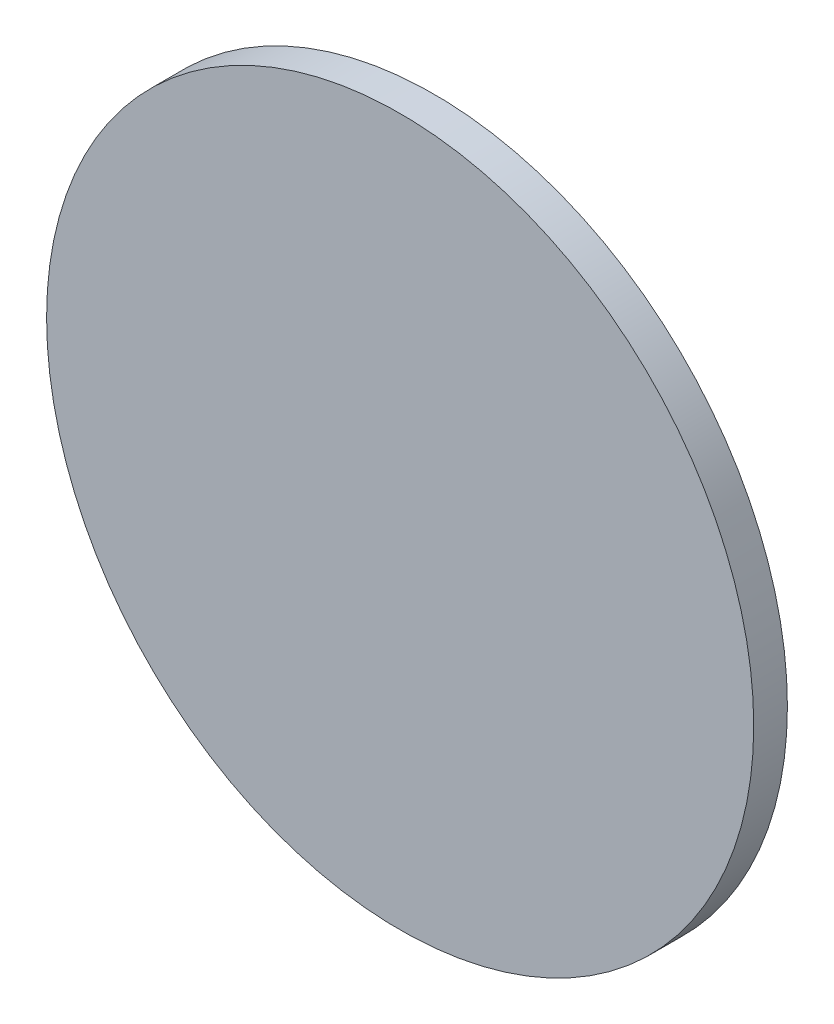
ISO-10303-21;
HEADER;
FILE_DESCRIPTION(('STEP AP214'),'2;1');
FILE_NAME('part.step','',(''),(''),'','','');
FILE_SCHEMA(('AUTOMOTIVE_DESIGN { 1 0 10303 214 1 1 1 1 }'));
ENDSEC;
DATA;
#1=APPLICATION_CONTEXT('core data for automotive mechanical design processes');
#2=APPLICATION_PROTOCOL_DEFINITION('international standard','automotive_design',2000,#1);
#3=PRODUCT_CONTEXT('',#1,'mechanical');
#4=PRODUCT('Part','Part','',(#3));
#5=PRODUCT_RELATED_PRODUCT_CATEGORY('part','',(#4));
#6=PRODUCT_DEFINITION_FORMATION('','',#4);
#7=PRODUCT_DEFINITION_CONTEXT('part definition',#1,'design');
#8=PRODUCT_DEFINITION('design','',#6,#7);
#9=PRODUCT_DEFINITION_SHAPE('','',#8);
#10=(LENGTH_UNIT() NAMED_UNIT(*) SI_UNIT(.MILLI.,.METRE.));
#11=(NAMED_UNIT(*) PLANE_ANGLE_UNIT() SI_UNIT($,.RADIAN.));
#12=(NAMED_UNIT(*) SI_UNIT($,.STERADIAN.) SOLID_ANGLE_UNIT());
#13=UNCERTAINTY_MEASURE_WITH_UNIT(LENGTH_MEASURE(1.E-05),#10,'distance_accuracy_value','');
#14=(GEOMETRIC_REPRESENTATION_CONTEXT(3) GLOBAL_UNCERTAINTY_ASSIGNED_CONTEXT((#13)) GLOBAL_UNIT_ASSIGNED_CONTEXT((#10,
#11,#12)) REPRESENTATION_CONTEXT('',''));
#15=CARTESIAN_POINT('',(0.,0.,0.));
#16=DIRECTION('',(0.,0.,1.));
#17=DIRECTION('',(1.,0.,0.));
#18=AXIS2_PLACEMENT_3D('',#15,#16,#17);
#19=CARTESIAN_POINT('',(0.,0.,5.08));
#20=DIRECTION('',(0.,0.,-1.));
#21=DIRECTION('',(-1.,0.,0.));
#22=AXIS2_PLACEMENT_3D('',#19,#20,#21);
#23=CYLINDRICAL_SURFACE('',#22,53.34);
#24=CARTESIAN_POINT('',(0.,0.,5.08));
#25=DIRECTION('',(0.,0.,1.));
#26=DIRECTION('',(1.,0.,0.));
#27=AXIS2_PLACEMENT_3D('',#24,#25,#26);
#28=CIRCLE('',#27,53.34);
#29=CARTESIAN_POINT('',(53.34,0.,5.08));
#30=VERTEX_POINT('',#29);
#31=EDGE_CURVE('E10',#30,#30,#28,.T.);
#32=ORIENTED_EDGE('',*,*,#31,.F.);
#33=EDGE_LOOP('',(#32));
#34=FACE_BOUND('',#33,.T.);
#35=CARTESIAN_POINT('',(0.,0.,0.));
#36=DIRECTION('',(0.,0.,1.));
#37=DIRECTION('',(1.,0.,0.));
#38=AXIS2_PLACEMENT_3D('',#35,#36,#37);
#39=CIRCLE('',#38,53.34);
#40=CARTESIAN_POINT('',(53.34,0.,0.));
#41=VERTEX_POINT('',#40);
#42=EDGE_CURVE('E36',#41,#41,#39,.T.);
#43=ORIENTED_EDGE('',*,*,#42,.T.);
#44=EDGE_LOOP('',(#43));
#45=FACE_BOUND('',#44,.T.);
#46=ADVANCED_FACE('F33',(#34,#45),#23,.T.);
#47=CARTESIAN_POINT('',(0.,0.,5.08));
#48=DIRECTION('',(0.,0.,1.));
#49=DIRECTION('',(1.,0.,0.));
#50=AXIS2_PLACEMENT_3D('',#47,#48,#49);
#51=PLANE('',#50);
#52=ORIENTED_EDGE('',*,*,#31,.T.);
#53=EDGE_LOOP('',(#52));
#54=FACE_BOUND('',#53,.T.);
#55=ADVANCED_FACE('F48',(#54),#51,.T.);
#56=CARTESIAN_POINT('',(0.,0.,0.));
#57=DIRECTION('',(0.,0.,1.));
#58=DIRECTION('',(1.,0.,0.));
#59=AXIS2_PLACEMENT_3D('',#56,#57,#58);
#60=PLANE('',#59);
#61=ORIENTED_EDGE('',*,*,#42,.F.);
#62=EDGE_LOOP('',(#61));
#63=FACE_BOUND('',#62,.T.);
#64=ADVANCED_FACE('F46',(#63),#60,.F.);
#65=CLOSED_SHELL('',(#46,#55,#64));
#66=MANIFOLD_SOLID_BREP('B2',#65);
#67=ADVANCED_BREP_SHAPE_REPRESENTATION('',(#18,#66),#14);
#68=SHAPE_DEFINITION_REPRESENTATION(#9,#67);
ENDSEC;
END-ISO-10303-21;
